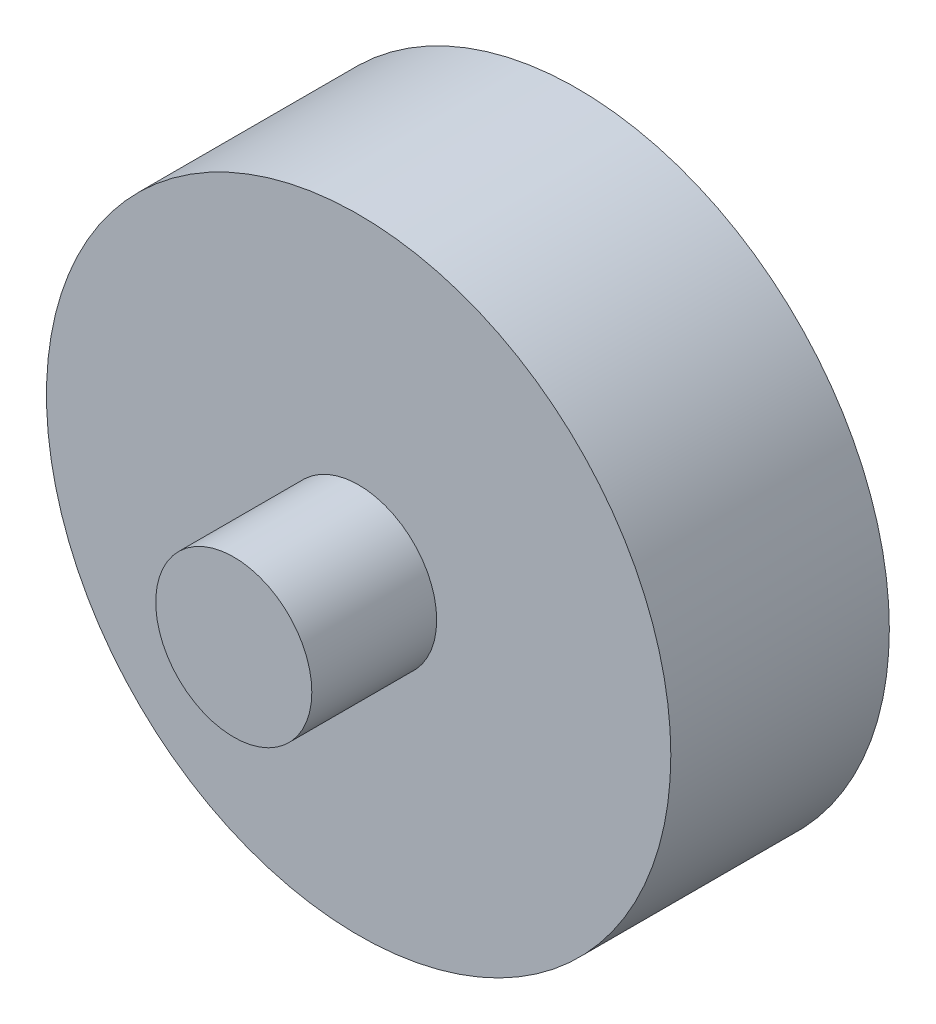
ISO-10303-21;
HEADER;
FILE_DESCRIPTION(('STEP AP214'),'2;1');
FILE_NAME('part.step','',(''),(''),'','','');
FILE_SCHEMA(('AUTOMOTIVE_DESIGN { 1 0 10303 214 1 1 1 1 }'));
ENDSEC;
DATA;
#1=APPLICATION_CONTEXT('core data for automotive mechanical design processes');
#2=APPLICATION_PROTOCOL_DEFINITION('international standard','automotive_design',2000,#1);
#3=PRODUCT_CONTEXT('',#1,'mechanical');
#4=PRODUCT('Part','Part','',(#3));
#5=PRODUCT_RELATED_PRODUCT_CATEGORY('part','',(#4));
#6=PRODUCT_DEFINITION_FORMATION('','',#4);
#7=PRODUCT_DEFINITION_CONTEXT('part definition',#1,'design');
#8=PRODUCT_DEFINITION('design','',#6,#7);
#9=PRODUCT_DEFINITION_SHAPE('','',#8);
#10=(LENGTH_UNIT() NAMED_UNIT(*) SI_UNIT(.MILLI.,.METRE.));
#11=(NAMED_UNIT(*) PLANE_ANGLE_UNIT() SI_UNIT($,.RADIAN.));
#12=(NAMED_UNIT(*) SI_UNIT($,.STERADIAN.) SOLID_ANGLE_UNIT());
#13=UNCERTAINTY_MEASURE_WITH_UNIT(LENGTH_MEASURE(1.E-05),#10,'distance_accuracy_value','');
#14=(GEOMETRIC_REPRESENTATION_CONTEXT(3) GLOBAL_UNCERTAINTY_ASSIGNED_CONTEXT((#13)) GLOBAL_UNIT_ASSIGNED_CONTEXT((#10,
#11,#12)) REPRESENTATION_CONTEXT('',''));
#15=CARTESIAN_POINT('',(0.,0.,0.));
#16=DIRECTION('',(0.,0.,1.));
#17=DIRECTION('',(1.,0.,0.));
#18=AXIS2_PLACEMENT_3D('',#15,#16,#17);
#19=CARTESIAN_POINT('',(10.,10.,11.));
#20=DIRECTION('',(0.,0.,-1.));
#21=DIRECTION('',(-1.,0.,0.));
#22=AXIS2_PLACEMENT_3D('',#19,#20,#21);
#23=CYLINDRICAL_SURFACE('',#22,2.5);
#24=CARTESIAN_POINT('',(10.,10.,7.));
#25=DIRECTION('',(0.,0.,1.));
#26=DIRECTION('',(1.,0.,0.));
#27=AXIS2_PLACEMENT_3D('',#24,#25,#26);
#28=CIRCLE('',#27,2.5);
#29=CARTESIAN_POINT('',(12.5,10.,7.));
#30=VERTEX_POINT('',#29);
#31=EDGE_CURVE('E46',#30,#30,#28,.T.);
#32=ORIENTED_EDGE('',*,*,#31,.T.);
#33=EDGE_LOOP('',(#32));
#34=FACE_BOUND('',#33,.T.);
#35=CARTESIAN_POINT('',(10.,10.,11.));
#36=DIRECTION('',(0.,0.,1.));
#37=DIRECTION('',(1.,0.,0.));
#38=AXIS2_PLACEMENT_3D('',#35,#36,#37);
#39=CIRCLE('',#38,2.5);
#40=CARTESIAN_POINT('',(12.5,10.,11.));
#41=VERTEX_POINT('',#40);
#42=EDGE_CURVE('E10',#41,#41,#39,.T.);
#43=ORIENTED_EDGE('',*,*,#42,.F.);
#44=EDGE_LOOP('',(#43));
#45=FACE_BOUND('',#44,.T.);
#46=ADVANCED_FACE('F31',(#34,#45),#23,.T.);
#47=CARTESIAN_POINT('',(10.,-12.1414213562373,11.));
#48=DIRECTION('',(0.,0.,1.));
#49=DIRECTION('',(1.,0.,0.));
#50=AXIS2_PLACEMENT_3D('',#47,#48,#49);
#51=PLANE('',#50);
#52=ORIENTED_EDGE('',*,*,#42,.T.);
#53=EDGE_LOOP('',(#52));
#54=FACE_BOUND('',#53,.T.);
#55=ADVANCED_FACE('F56',(#54),#51,.T.);
#56=CARTESIAN_POINT('',(10.,10.,7.));
#57=DIRECTION('',(0.,0.,1.));
#58=DIRECTION('',(1.,0.,0.));
#59=AXIS2_PLACEMENT_3D('',#56,#57,#58);
#60=PLANE('',#59);
#61=CARTESIAN_POINT('',(10.,10.,7.));
#62=DIRECTION('',(0.,0.,1.));
#63=DIRECTION('',(1.,0.,0.));
#64=AXIS2_PLACEMENT_3D('',#61,#62,#63);
#65=CIRCLE('',#64,10.);
#66=CARTESIAN_POINT('',(20.,10.,7.));
#67=VERTEX_POINT('',#66);
#68=EDGE_CURVE('E37',#67,#67,#65,.T.);
#69=ORIENTED_EDGE('',*,*,#68,.T.);
#70=EDGE_LOOP('',(#69));
#71=FACE_BOUND('',#70,.T.);
#72=ORIENTED_EDGE('',*,*,#31,.F.);
#73=EDGE_LOOP('',(#72));
#74=FACE_BOUND('',#73,.T.);
#75=ADVANCED_FACE('F53',(#71,#74),#60,.T.);
#76=CARTESIAN_POINT('',(10.,10.,7.));
#77=DIRECTION('',(0.,0.,-1.));
#78=DIRECTION('',(-1.,0.,0.));
#79=AXIS2_PLACEMENT_3D('',#76,#77,#78);
#80=CYLINDRICAL_SURFACE('',#79,10.);
#81=ORIENTED_EDGE('',*,*,#68,.F.);
#82=EDGE_LOOP('',(#81));
#83=FACE_BOUND('',#82,.T.);
#84=CARTESIAN_POINT('',(10.,10.,0.));
#85=DIRECTION('',(0.,0.,1.));
#86=DIRECTION('',(1.,0.,0.));
#87=AXIS2_PLACEMENT_3D('',#84,#85,#86);
#88=CIRCLE('',#87,10.);
#89=CARTESIAN_POINT('',(20.,10.,0.));
#90=VERTEX_POINT('',#89);
#91=EDGE_CURVE('E41',#90,#90,#88,.T.);
#92=ORIENTED_EDGE('',*,*,#91,.T.);
#93=EDGE_LOOP('',(#92));
#94=FACE_BOUND('',#93,.T.);
#95=ADVANCED_FACE('F55',(#83,#94),#80,.T.);
#96=CARTESIAN_POINT('',(10.,-12.1414213562373,0.));
#97=DIRECTION('',(0.,0.,1.));
#98=DIRECTION('',(1.,0.,0.));
#99=AXIS2_PLACEMENT_3D('',#96,#97,#98);
#100=PLANE('',#99);
#101=ORIENTED_EDGE('',*,*,#91,.F.);
#102=EDGE_LOOP('',(#101));
#103=FACE_BOUND('',#102,.T.);
#104=ADVANCED_FACE('F62',(#103),#100,.F.);
#105=CLOSED_SHELL('',(#46,#55,#75,#95,#104));
#106=MANIFOLD_SOLID_BREP('B2',#105);
#107=ADVANCED_BREP_SHAPE_REPRESENTATION('',(#18,#106),#14);
#108=SHAPE_DEFINITION_REPRESENTATION(#9,#107);
ENDSEC;
END-ISO-10303-21;
